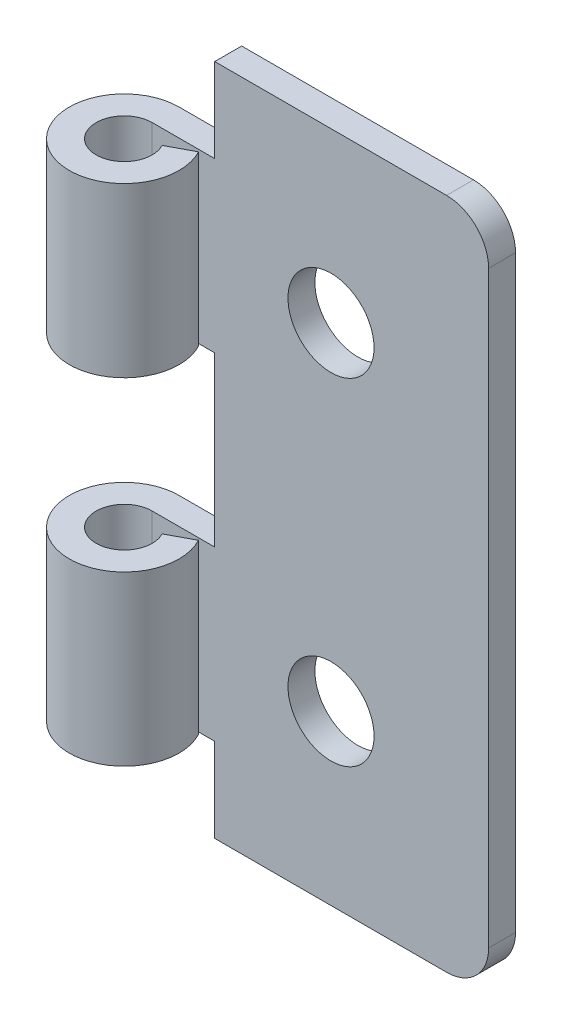
ISO-10303-21;
HEADER;
FILE_DESCRIPTION(('STEP AP214'),'2;1');
FILE_NAME('part.step','',(''),(''),'','','');
FILE_SCHEMA(('AUTOMOTIVE_DESIGN { 1 0 10303 214 1 1 1 1 }'));
ENDSEC;
DATA;
#1=APPLICATION_CONTEXT('core data for automotive mechanical design processes');
#2=APPLICATION_PROTOCOL_DEFINITION('international standard','automotive_design',2000,#1);
#3=PRODUCT_CONTEXT('',#1,'mechanical');
#4=PRODUCT('Part','Part','',(#3));
#5=PRODUCT_RELATED_PRODUCT_CATEGORY('part','',(#4));
#6=PRODUCT_DEFINITION_FORMATION('','',#4);
#7=PRODUCT_DEFINITION_CONTEXT('part definition',#1,'design');
#8=PRODUCT_DEFINITION('design','',#6,#7);
#9=PRODUCT_DEFINITION_SHAPE('','',#8);
#10=(LENGTH_UNIT() NAMED_UNIT(*) SI_UNIT(.MILLI.,.METRE.));
#11=(NAMED_UNIT(*) PLANE_ANGLE_UNIT() SI_UNIT($,.RADIAN.));
#12=(NAMED_UNIT(*) SI_UNIT($,.STERADIAN.) SOLID_ANGLE_UNIT());
#13=UNCERTAINTY_MEASURE_WITH_UNIT(LENGTH_MEASURE(1.E-05),#10,'distance_accuracy_value','');
#14=(GEOMETRIC_REPRESENTATION_CONTEXT(3) GLOBAL_UNCERTAINTY_ASSIGNED_CONTEXT((#13)) GLOBAL_UNIT_ASSIGNED_CONTEXT((#10,
#11,#12)) REPRESENTATION_CONTEXT('',''));
#15=CARTESIAN_POINT('',(0.,0.,0.));
#16=DIRECTION('',(0.,0.,1.));
#17=DIRECTION('',(1.,0.,0.));
#18=AXIS2_PLACEMENT_3D('',#15,#16,#17);
#19=CARTESIAN_POINT('',(2.70058281293117E-10,-19.0500000015001,4.1486666669938));
#20=DIRECTION('',(0.,1.,0.));
#21=DIRECTION('',(-0.990472978806965,0.,0.137707219321494));
#22=AXIS2_PLACEMENT_3D('',#19,#20,#21);
#23=CYLINDRICAL_SURFACE('',#22,2.11666666763317);
#24=CARTESIAN_POINT('',(2.70058281293117E-10,-19.0500000015001,4.1486666669938));
#25=DIRECTION('',(0.,1.,0.));
#26=DIRECTION('',(-0.990472978806965,0.,0.137707219321494));
#27=AXIS2_PLACEMENT_3D('',#24,#25,#26);
#28=CIRCLE('',#27,2.11666666763317);
#29=CARTESIAN_POINT('',(1.86869045346746,-19.0500000015001,3.15454707056779));
#30=VERTEX_POINT('',#29);
#31=CARTESIAN_POINT('',(1.96545904551648E-09,-19.0500000015001,2.03199999936063));
#32=VERTEX_POINT('',#31);
#33=EDGE_CURVE('E200',#30,#32,#28,.F.);
#34=ORIENTED_EDGE('',*,*,#33,.T.);
#35=DIRECTION('',(0.,-1.,0.));
#36=VECTOR('',#35,1.);
#37=CARTESIAN_POINT('',(3.66086154446332E-09,-19.0500000015001,2.03199999936063));
#38=LINE('',#37,#36);
#39=CARTESIAN_POINT('',(1.31762586952355E-08,-6.35000000037509,2.03199999955212));
#40=VERTEX_POINT('',#39);
#41=EDGE_CURVE('E262',#40,#32,#38,.T.);
#42=ORIENTED_EDGE('',*,*,#41,.F.);
#43=CARTESIAN_POINT('',(2.70058281293117E-10,-6.35000000037509,4.1486666669938));
#44=DIRECTION('',(0.,1.,0.));
#45=DIRECTION('',(-0.990472978806965,0.,0.137707219321494));
#46=AXIS2_PLACEMENT_3D('',#43,#44,#45);
#47=CIRCLE('',#46,2.11666666763317);
#48=CARTESIAN_POINT('',(1.86869045346746,-6.35000000037509,3.15454707056779));
#49=VERTEX_POINT('',#48);
#50=EDGE_CURVE('E183',#49,#40,#47,.F.);
#51=ORIENTED_EDGE('',*,*,#50,.F.);
#52=DIRECTION('',(0.,-1.,0.));
#53=VECTOR('',#52,1.);
#54=CARTESIAN_POINT('',(1.86869045346746,-19.0500000015001,3.15454707056779));
#55=LINE('',#54,#53);
#56=EDGE_CURVE('E164',#30,#49,#55,.F.);
#57=ORIENTED_EDGE('',*,*,#56,.F.);
#58=EDGE_LOOP('',(#34,#42,#51,#57));
#59=FACE_BOUND('',#58,.T.);
#60=ADVANCED_FACE('F17',(#59),#23,.F.);
#61=CARTESIAN_POINT('',(3.66263328715336,-19.0500000015001,2.20019225873489));
#62=DIRECTION('',(-0.469662801246651,0.,-0.882845882997225));
#63=DIRECTION('',(0.882845882997225,0.,-0.469662801246651));
#64=AXIS2_PLACEMENT_3D('',#61,#62,#63);
#65=PLANE('',#64);
#66=DIRECTION('',(-0.882845882997224,0.,0.469662801246651));
#67=VECTOR('',#66,1.);
#68=CARTESIAN_POINT('',(3.66263328715336,-19.0500000015001,2.20019225873488));
#69=LINE('',#68,#67);
#70=CARTESIAN_POINT('',(3.66263328715336,-19.0500000015001,2.20019225873488));
#71=VERTEX_POINT('',#70);
#72=EDGE_CURVE('E203',#71,#30,#69,.T.);
#73=ORIENTED_EDGE('',*,*,#72,.T.);
#74=ORIENTED_EDGE('',*,*,#56,.T.);
#75=DIRECTION('',(-0.882845882997224,0.,0.469662801246651));
#76=VECTOR('',#75,1.);
#77=CARTESIAN_POINT('',(3.66263328715336,-6.35000000037509,2.20019225873488));
#78=LINE('',#77,#76);
#79=CARTESIAN_POINT('',(3.66263328715336,-6.35000000037509,2.20019225873488));
#80=VERTEX_POINT('',#79);
#81=EDGE_CURVE('E146',#80,#49,#78,.T.);
#82=ORIENTED_EDGE('',*,*,#81,.F.);
#83=DIRECTION('',(0.,-1.,0.));
#84=VECTOR('',#83,1.);
#85=CARTESIAN_POINT('',(3.66263328715336,-19.0500000015001,2.20019225873489));
#86=LINE('',#85,#84);
#87=EDGE_CURVE('E157',#80,#71,#86,.T.);
#88=ORIENTED_EDGE('',*,*,#87,.T.);
#89=EDGE_LOOP('',(#73,#74,#82,#88));
#90=FACE_BOUND('',#89,.T.);
#91=ADVANCED_FACE('F167',(#90),#65,.T.);
#92=CARTESIAN_POINT('',(1.86869045251002,19.0500000004999,3.15454707011616));
#93=DIRECTION('',(0.469662801482301,0.,0.882845882871862));
#94=DIRECTION('',(-0.882845882871862,0.,0.469662801482301));
#95=AXIS2_PLACEMENT_3D('',#92,#93,#94);
#96=PLANE('',#95);
#97=DIRECTION('',(0.,-1.,0.));
#98=VECTOR('',#97,1.);
#99=CARTESIAN_POINT('',(1.86869045251002,19.0500000004999,3.15454707011616));
#100=LINE('',#99,#98);
#101=CARTESIAN_POINT('',(1.86869045251002,19.0500000004999,3.15454707011616));
#102=VERTEX_POINT('',#101);
#103=CARTESIAN_POINT('',(1.86869045251002,6.3500000004999,3.15454707011616));
#104=VERTEX_POINT('',#103);
#105=EDGE_CURVE('E263',#102,#104,#100,.T.);
#106=ORIENTED_EDGE('',*,*,#105,.F.);
#107=DIRECTION('',(-0.882845882871862,0.,0.469662801482301));
#108=VECTOR('',#107,1.);
#109=CARTESIAN_POINT('',(3.66263328650564,19.0500000004999,2.20019225750412));
#110=LINE('',#109,#108);
#111=CARTESIAN_POINT('',(3.66263328650564,19.0500000004999,2.20019225750412));
#112=VERTEX_POINT('',#111);
#113=EDGE_CURVE('E314',#112,#102,#110,.T.);
#114=ORIENTED_EDGE('',*,*,#113,.F.);
#115=DIRECTION('',(0.,-1.,0.));
#116=VECTOR('',#115,1.);
#117=CARTESIAN_POINT('',(3.66263328650564,19.0500000004999,2.20019225750412));
#118=LINE('',#117,#116);
#119=CARTESIAN_POINT('',(3.66263328650564,6.3500000004999,2.20019225750412));
#120=VERTEX_POINT('',#119);
#121=EDGE_CURVE('E264',#120,#112,#118,.F.);
#122=ORIENTED_EDGE('',*,*,#121,.F.);
#123=DIRECTION('',(-0.882845882871862,0.,0.469662801482301));
#124=VECTOR('',#123,1.);
#125=CARTESIAN_POINT('',(3.66263328650564,6.35000000049991,2.20019225750412));
#126=LINE('',#125,#124);
#127=EDGE_CURVE('E274',#120,#104,#126,.T.);
#128=ORIENTED_EDGE('',*,*,#127,.T.);
#129=EDGE_LOOP('',(#106,#114,#122,#128));
#130=FACE_BOUND('',#129,.T.);
#131=ADVANCED_FACE('F507',(#130),#96,.F.);
#132=CARTESIAN_POINT('',(1.36959887875321E-10,19.0500000004999,4.14866666674361));
#133=DIRECTION('',(0.,-1.,0.));
#134=DIRECTION('',(0.990472978806965,0.,-0.137707219321494));
#135=AXIS2_PLACEMENT_3D('',#132,#133,#134);
#136=CYLINDRICAL_SURFACE('',#135,2.11666666700002);
#137=CARTESIAN_POINT('',(1.36959887875321E-10,19.0500000004999,4.14866666674361));
#138=DIRECTION('',(0.,-1.,0.));
#139=DIRECTION('',(0.990472978806965,0.,-0.137707219321494));
#140=AXIS2_PLACEMENT_3D('',#137,#138,#139);
#141=CIRCLE('',#140,2.11666666700002);
#142=CARTESIAN_POINT('',(1.36963357322273E-10,19.0500000004999,2.0319999995521));
#143=VERTEX_POINT('',#142);
#144=EDGE_CURVE('E310',#102,#143,#141,.T.);
#145=ORIENTED_EDGE('',*,*,#144,.F.);
#146=ORIENTED_EDGE('',*,*,#105,.T.);
#147=CARTESIAN_POINT('',(1.36959887875321E-10,6.35000000049991,4.14866666674361));
#148=DIRECTION('',(0.,-1.,0.));
#149=DIRECTION('',(0.990472978806965,0.,-0.137707219321494));
#150=AXIS2_PLACEMENT_3D('',#147,#148,#149);
#151=CIRCLE('',#150,2.11666666700002);
#152=CARTESIAN_POINT('',(1.36959887875321E-10,6.35000000049991,2.03199999955211));
#153=VERTEX_POINT('',#152);
#154=EDGE_CURVE('E322',#104,#153,#151,.T.);
#155=ORIENTED_EDGE('',*,*,#154,.T.);
#156=DIRECTION('',(0.,-1.,0.));
#157=VECTOR('',#156,1.);
#158=CARTESIAN_POINT('',(1.36961622598797E-10,-19.0500000015001,2.03199999936063));
#159=LINE('',#158,#157);
#160=EDGE_CURVE('E258',#143,#153,#159,.T.);
#161=ORIENTED_EDGE('',*,*,#160,.F.);
#162=EDGE_LOOP('',(#145,#146,#155,#161));
#163=FACE_BOUND('',#162,.T.);
#164=ADVANCED_FACE('F361',(#163),#136,.F.);
#165=CARTESIAN_POINT('',(2.70058281293117E-10,-19.0500000015001,2.03199999936063));
#166=DIRECTION('',(0.,0.,1.));
#167=DIRECTION('',(-1.,0.,0.));
#168=AXIS2_PLACEMENT_3D('',#165,#166,#167);
#169=PLANE('',#168);
#170=DIRECTION('',(1.,0.,0.));
#171=VECTOR('',#170,1.);
#172=CARTESIAN_POINT('',(4.72096662113696,-25.4000000015001,2.03199999974361));
#173=LINE('',#172,#171);
#174=CARTESIAN_POINT('',(4.72096662113696,-25.4000000015001,2.03199999948829));
#175=VERTEX_POINT('',#174);
#176=CARTESIAN_POINT('',(22.2250000022701,-25.4000000015001,2.03199999974364));
#177=VERTEX_POINT('',#176);
#178=EDGE_CURVE('E225',#175,#177,#173,.T.);
#179=ORIENTED_EDGE('',*,*,#178,.T.);
#180=CARTESIAN_POINT('',(22.2250000022701,-22.2250000015001,2.03199999974368));
#181=DIRECTION('',(0.,0.,1.));
#182=DIRECTION('',(-1.,0.,0.));
#183=AXIS2_PLACEMENT_3D('',#180,#181,#182);
#184=CIRCLE('',#183,3.175);
#185=CARTESIAN_POINT('',(25.4000000022701,-22.2250000015001,2.03199999974368));
#186=VERTEX_POINT('',#185);
#187=EDGE_CURVE('E230',#186,#177,#184,.F.);
#188=ORIENTED_EDGE('',*,*,#187,.F.);
#189=DIRECTION('',(0.,-1.,0.));
#190=VECTOR('',#189,1.);
#191=CARTESIAN_POINT('',(25.4000000022701,-2.42604837035899,2.03199999974367));
#192=LINE('',#191,#190);
#193=CARTESIAN_POINT('',(25.4000000022701,22.2250000014999,2.03199999974362));
#194=VERTEX_POINT('',#193);
#195=EDGE_CURVE('E234',#186,#194,#192,.F.);
#196=ORIENTED_EDGE('',*,*,#195,.T.);
#197=CARTESIAN_POINT('',(22.2250000022701,22.2250000014999,2.03199999974358));
#198=DIRECTION('',(0.,0.,-1.));
#199=DIRECTION('',(1.,0.,0.));
#200=AXIS2_PLACEMENT_3D('',#197,#198,#199);
#201=CIRCLE('',#200,3.175);
#202=CARTESIAN_POINT('',(22.2250000022701,25.4000000014999,2.03199999974358));
#203=VERTEX_POINT('',#202);
#204=EDGE_CURVE('E239',#203,#194,#201,.T.);
#205=ORIENTED_EDGE('',*,*,#204,.F.);
#206=DIRECTION('',(-1.,0.,0.));
#207=VECTOR('',#206,1.);
#208=CARTESIAN_POINT('',(22.2250000022701,25.4000000014999,2.03199999974358));
#209=LINE('',#208,#207);
#210=CARTESIAN_POINT('',(4.72096662113696,25.4000000014999,2.03199999974359));
#211=VERTEX_POINT('',#210);
#212=EDGE_CURVE('E252',#203,#211,#209,.T.);
#213=ORIENTED_EDGE('',*,*,#212,.T.);
#214=DIRECTION('',(0.,-1.,0.));
#215=VECTOR('',#214,1.);
#216=CARTESIAN_POINT('',(4.72096662113696,25.4000000014999,2.03199999974359));
#217=LINE('',#216,#215);
#218=CARTESIAN_POINT('',(4.72096662113696,19.0500000004999,2.03199999974359));
#219=VERTEX_POINT('',#218);
#220=EDGE_CURVE('E244',#211,#219,#217,.T.);
#221=ORIENTED_EDGE('',*,*,#220,.T.);
#222=DIRECTION('',(1.,0.,0.));
#223=VECTOR('',#222,1.);
#224=CARTESIAN_POINT('',(1.36959887875321E-10,19.0500000004999,2.03199999974358));
#225=LINE('',#224,#223);
#226=EDGE_CURVE('E245',#143,#219,#225,.T.);
#227=ORIENTED_EDGE('',*,*,#226,.F.);
#228=ORIENTED_EDGE('',*,*,#160,.T.);
#229=DIRECTION('',(1.,0.,0.));
#230=VECTOR('',#229,1.);
#231=CARTESIAN_POINT('',(1.36959887875321E-10,6.35000000049991,2.03199999974358));
#232=LINE('',#231,#230);
#233=CARTESIAN_POINT('',(4.72096662466088,6.35000000049991,2.03200001641314));
#234=VERTEX_POINT('',#233);
#235=EDGE_CURVE('E324',#153,#234,#232,.T.);
#236=ORIENTED_EDGE('',*,*,#235,.T.);
#237=DIRECTION('',(0.,-1.,0.));
#238=VECTOR('',#237,1.);
#239=CARTESIAN_POINT('',(4.72096662466088,-2.42604837035896,2.03200004975225));
#240=LINE('',#239,#238);
#241=CARTESIAN_POINT('',(4.72096662466088,-6.350000005626,2.03200004975225));
#242=VERTEX_POINT('',#241);
#243=EDGE_CURVE('E175',#242,#234,#240,.F.);
#244=ORIENTED_EDGE('',*,*,#243,.F.);
#245=DIRECTION('',(1.,0.,1.05928802118793E-08));
#246=VECTOR('',#245,1.);
#247=CARTESIAN_POINT('',(3.6608632791868E-09,-6.35000000037509,2.03199999974361));
#248=LINE('',#247,#246);
#249=EDGE_CURVE('E153',#40,#242,#248,.T.);
#250=ORIENTED_EDGE('',*,*,#249,.F.);
#251=ORIENTED_EDGE('',*,*,#41,.T.);
#252=DIRECTION('',(1.,0.,0.));
#253=VECTOR('',#252,1.);
#254=CARTESIAN_POINT('',(2.70056546569641E-10,-19.0500000015001,2.03199999936063));
#255=LINE('',#254,#253);
#256=CARTESIAN_POINT('',(4.72096662113696,-19.0500000015001,2.03199999936063));
#257=VERTEX_POINT('',#256);
#258=EDGE_CURVE('E196',#32,#257,#255,.T.);
#259=ORIENTED_EDGE('',*,*,#258,.T.);
#260=DIRECTION('',(0.,-1.,0.));
#261=VECTOR('',#260,1.);
#262=CARTESIAN_POINT('',(4.72096662113697,-25.4000000015001,2.03199999936063));
#263=LINE('',#262,#261);
#264=EDGE_CURVE('E219',#257,#175,#263,.T.);
#265=ORIENTED_EDGE('',*,*,#264,.T.);
#266=EDGE_LOOP('',(#179,#188,#196,#205,#213,#221,#227,#228,#236,#244,#250,#251,#259,#265));
#267=FACE_BOUND('',#266,.T.);
#268=CARTESIAN_POINT('',(13.499676668137,12.7000000006249,2.03199999936062));
#269=DIRECTION('',(0.,0.,-1.));
#270=DIRECTION('',(1.,0.,0.));
#271=AXIS2_PLACEMENT_3D('',#268,#269,#270);
#272=CIRCLE('',#271,3.24999999999999);
#273=CARTESIAN_POINT('',(16.7496766681369,12.7000000006249,2.03199999936062));
#274=VERTEX_POINT('',#273);
#275=EDGE_CURVE('E255',#274,#274,#272,.T.);
#276=ORIENTED_EDGE('',*,*,#275,.T.);
#277=EDGE_LOOP('',(#276));
#278=FACE_BOUND('',#277,.T.);
#279=CARTESIAN_POINT('',(13.499676668137,-12.7000000003751,2.03199999936063));
#280=DIRECTION('',(0.,0.,-1.));
#281=DIRECTION('',(1.,0.,0.));
#282=AXIS2_PLACEMENT_3D('',#279,#280,#281);
#283=CIRCLE('',#282,3.24999999999999);
#284=CARTESIAN_POINT('',(16.7496766681369,-12.7000000003751,2.03199999936062));
#285=VERTEX_POINT('',#284);
#286=EDGE_CURVE('E20',#285,#285,#283,.T.);
#287=ORIENTED_EDGE('',*,*,#286,.T.);
#288=EDGE_LOOP('',(#287));
#289=FACE_BOUND('',#288,.T.);
#290=ADVANCED_FACE('F345',(#267,#278,#289),#169,.T.);
#291=CARTESIAN_POINT('',(13.499676668137,-12.7000000003751,0.));
#292=DIRECTION('',(0.,0.,-1.));
#293=DIRECTION('',(1.,0.,0.));
#294=AXIS2_PLACEMENT_3D('',#291,#292,#293);
#295=CYLINDRICAL_SURFACE('',#294,3.24999999999999);
#296=CARTESIAN_POINT('',(13.499676668137,-12.7000000003751,0.));
#297=DIRECTION('',(0.,0.,-1.));
#298=DIRECTION('',(1.,0.,0.));
#299=AXIS2_PLACEMENT_3D('',#296,#297,#298);
#300=CIRCLE('',#299,3.24999999999999);
#301=CARTESIAN_POINT('',(16.7496766681369,-12.7000000003751,0.));
#302=VERTEX_POINT('',#301);
#303=EDGE_CURVE('E306',#302,#302,#300,.F.);
#304=ORIENTED_EDGE('',*,*,#303,.F.);
#305=EDGE_LOOP('',(#304));
#306=FACE_BOUND('',#305,.T.);
#307=ORIENTED_EDGE('',*,*,#286,.F.);
#308=EDGE_LOOP('',(#307));
#309=FACE_BOUND('',#308,.T.);
#310=ADVANCED_FACE('F347',(#306,#309),#295,.F.);
#311=CARTESIAN_POINT('',(13.499676668137,12.7000000006249,0.));
#312=DIRECTION('',(0.,0.,-1.));
#313=DIRECTION('',(1.,0.,0.));
#314=AXIS2_PLACEMENT_3D('',#311,#312,#313);
#315=CYLINDRICAL_SURFACE('',#314,3.24999999999999);
#316=CARTESIAN_POINT('',(13.499676668137,12.7000000006249,0.));
#317=DIRECTION('',(0.,0.,-1.));
#318=DIRECTION('',(1.,0.,0.));
#319=AXIS2_PLACEMENT_3D('',#316,#317,#318);
#320=CIRCLE('',#319,3.24999999999999);
#321=CARTESIAN_POINT('',(16.7496766681369,12.7000000006249,0.));
#322=VERTEX_POINT('',#321);
#323=EDGE_CURVE('E302',#322,#322,#320,.F.);
#324=ORIENTED_EDGE('',*,*,#323,.F.);
#325=EDGE_LOOP('',(#324));
#326=FACE_BOUND('',#325,.T.);
#327=ORIENTED_EDGE('',*,*,#275,.F.);
#328=EDGE_LOOP('',(#327));
#329=FACE_BOUND('',#328,.T.);
#330=ADVANCED_FACE('F349',(#326,#329),#315,.F.);
#331=CARTESIAN_POINT('',(-15.0777173125147,25.4000000014999,2.76877995558586));
#332=DIRECTION('',(0.,-1.,0.));
#333=DIRECTION('',(0.990472978806965,0.,-0.137707219321494));
#334=AXIS2_PLACEMENT_3D('',#331,#332,#333);
#335=PLANE('',#334);
#336=DIRECTION('',(0.,0.,-1.));
#337=VECTOR('',#336,1.);
#338=CARTESIAN_POINT('',(22.2250000022701,25.4000000014999,2.7687799555858));
#339=LINE('',#338,#337);
#340=CARTESIAN_POINT('',(22.2250000022701,25.4000000014999,-1.28167008256463E-10));
#341=VERTEX_POINT('',#340);
#342=EDGE_CURVE('E235',#341,#203,#339,.F.);
#343=ORIENTED_EDGE('',*,*,#342,.F.);
#344=DIRECTION('',(1.,0.,0.));
#345=VECTOR('',#344,1.);
#346=CARTESIAN_POINT('',(2.11563514084296,25.4000000014999,0.));
#347=LINE('',#346,#345);
#348=CARTESIAN_POINT('',(4.72096662113696,25.4000000014999,0.));
#349=VERTEX_POINT('',#348);
#350=EDGE_CURVE('E301',#349,#341,#347,.T.);
#351=ORIENTED_EDGE('',*,*,#350,.F.);
#352=DIRECTION('',(0.,0.,1.));
#353=VECTOR('',#352,1.);
#354=CARTESIAN_POINT('',(4.72096662113696,25.4000000014999,2.03199999974359));
#355=LINE('',#354,#353);
#356=EDGE_CURVE('E240',#349,#211,#355,.T.);
#357=ORIENTED_EDGE('',*,*,#356,.T.);
#358=ORIENTED_EDGE('',*,*,#212,.F.);
#359=EDGE_LOOP('',(#343,#351,#357,#358));
#360=FACE_BOUND('',#359,.T.);
#361=ADVANCED_FACE('F358',(#360),#335,.F.);
#362=CARTESIAN_POINT('',(22.2250000022701,22.2250000014999,2.7687799555858));
#363=DIRECTION('',(0.,0.,-1.));
#364=DIRECTION('',(1.,0.,0.));
#365=AXIS2_PLACEMENT_3D('',#362,#363,#364);
#366=CYLINDRICAL_SURFACE('',#365,3.175);
#367=CARTESIAN_POINT('',(22.2250000022701,22.2250000014999,-2.56323608172071E-10));
#368=DIRECTION('',(0.,0.,-1.));
#369=DIRECTION('',(1.,0.,0.));
#370=AXIS2_PLACEMENT_3D('',#367,#368,#369);
#371=CIRCLE('',#370,3.175);
#372=CARTESIAN_POINT('',(25.4000000022701,22.2250000014999,-1.28168742979939E-10));
#373=VERTEX_POINT('',#372);
#374=EDGE_CURVE('E297',#341,#373,#371,.T.);
#375=ORIENTED_EDGE('',*,*,#374,.F.);
#376=ORIENTED_EDGE('',*,*,#342,.T.);
#377=ORIENTED_EDGE('',*,*,#204,.T.);
#378=DIRECTION('',(0.,0.,-1.));
#379=VECTOR('',#378,1.);
#380=CARTESIAN_POINT('',(25.4000000022701,22.2250000014999,2.76877995558579));
#381=LINE('',#380,#379);
#382=EDGE_CURVE('E231',#194,#373,#381,.T.);
#383=ORIENTED_EDGE('',*,*,#382,.T.);
#384=EDGE_LOOP('',(#375,#376,#377,#383));
#385=FACE_BOUND('',#384,.T.);
#386=ADVANCED_FACE('F417',(#385),#366,.T.);
#387=CARTESIAN_POINT('',(25.4000000022701,-2.42604837035899,2.76877995558579));
#388=DIRECTION('',(-1.,0.,0.));
#389=DIRECTION('',(0.,0.,-1.));
#390=AXIS2_PLACEMENT_3D('',#387,#388,#389);
#391=PLANE('',#390);
#392=ORIENTED_EDGE('',*,*,#382,.F.);
#393=ORIENTED_EDGE('',*,*,#195,.F.);
#394=DIRECTION('',(0.,0.,1.));
#395=VECTOR('',#394,1.);
#396=CARTESIAN_POINT('',(25.4000000022701,-22.2250000015001,2.7687799555858));
#397=LINE('',#396,#395);
#398=CARTESIAN_POINT('',(25.4000000022701,-22.2250000015001,-1.28209942662494E-10));
#399=VERTEX_POINT('',#398);
#400=EDGE_CURVE('E226',#399,#186,#397,.T.);
#401=ORIENTED_EDGE('',*,*,#400,.F.);
#402=DIRECTION('',(0.,-1.,0.));
#403=VECTOR('',#402,1.);
#404=CARTESIAN_POINT('',(25.4000000022701,-19.0500000015001,0.));
#405=LINE('',#404,#403);
#406=EDGE_CURVE('E296',#373,#399,#405,.T.);
#407=ORIENTED_EDGE('',*,*,#406,.F.);
#408=EDGE_LOOP('',(#392,#393,#401,#407));
#409=FACE_BOUND('',#408,.T.);
#410=ADVANCED_FACE('F413',(#409),#391,.F.);
#411=CARTESIAN_POINT('',(22.2250000022701,-22.2250000015001,2.7687799555858));
#412=DIRECTION('',(0.,0.,1.));
#413=DIRECTION('',(-1.,0.,0.));
#414=AXIS2_PLACEMENT_3D('',#411,#412,#413);
#415=CYLINDRICAL_SURFACE('',#414,3.175);
#416=ORIENTED_EDGE('',*,*,#187,.T.);
#417=DIRECTION('',(0.,0.,-1.));
#418=VECTOR('',#417,1.);
#419=CARTESIAN_POINT('',(22.2250000022701,-25.4000000015001,2.03199999974359));
#420=LINE('',#419,#418);
#421=CARTESIAN_POINT('',(22.2250000022701,-25.4000000015001,-1.28206906896411E-10));
#422=VERTEX_POINT('',#421);
#423=EDGE_CURVE('E222',#177,#422,#420,.T.);
#424=ORIENTED_EDGE('',*,*,#423,.T.);
#425=CARTESIAN_POINT('',(22.2250000022701,-22.2250000015001,-2.56410778026739E-10));
#426=DIRECTION('',(0.,0.,1.));
#427=DIRECTION('',(-1.,0.,0.));
#428=AXIS2_PLACEMENT_3D('',#425,#426,#427);
#429=CIRCLE('',#428,3.175);
#430=EDGE_CURVE('E292',#399,#422,#429,.F.);
#431=ORIENTED_EDGE('',*,*,#430,.F.);
#432=ORIENTED_EDGE('',*,*,#400,.T.);
#433=EDGE_LOOP('',(#416,#424,#431,#432));
#434=FACE_BOUND('',#433,.T.);
#435=ADVANCED_FACE('F409',(#434),#415,.T.);
#436=CARTESIAN_POINT('',(-15.0777173125147,-25.4000000015001,2.76877995558587));
#437=DIRECTION('',(0.,1.,0.));
#438=DIRECTION('',(-0.990472978806965,0.,0.137707219321494));
#439=AXIS2_PLACEMENT_3D('',#436,#437,#438);
#440=PLANE('',#439);
#441=ORIENTED_EDGE('',*,*,#423,.F.);
#442=ORIENTED_EDGE('',*,*,#178,.F.);
#443=DIRECTION('',(0.,0.,1.));
#444=VECTOR('',#443,1.);
#445=CARTESIAN_POINT('',(4.72096662113696,-25.4000000015001,-2.56389093983289E-10));
#446=LINE('',#445,#444);
#447=CARTESIAN_POINT('',(4.72096662113696,-25.4000000015001,0.));
#448=VERTEX_POINT('',#447);
#449=EDGE_CURVE('E206',#175,#448,#446,.F.);
#450=ORIENTED_EDGE('',*,*,#449,.T.);
#451=DIRECTION('',(1.,0.,0.));
#452=VECTOR('',#451,1.);
#453=CARTESIAN_POINT('',(2.11563514084296,-25.4000000015001,0.));
#454=LINE('',#453,#452);
#455=EDGE_CURVE('E214',#422,#448,#454,.F.);
#456=ORIENTED_EDGE('',*,*,#455,.F.);
#457=EDGE_LOOP('',(#441,#442,#450,#456));
#458=FACE_BOUND('',#457,.T.);
#459=ADVANCED_FACE('F405',(#458),#440,.F.);
#460=CARTESIAN_POINT('',(4.72096662113696,-25.4000000015001,-2.56389093983289E-10));
#461=DIRECTION('',(1.,0.,0.));
#462=DIRECTION('',(0.,0.,1.));
#463=AXIS2_PLACEMENT_3D('',#460,#461,#462);
#464=PLANE('',#463);
#465=DIRECTION('',(0.,-1.,0.));
#466=VECTOR('',#465,1.);
#467=CARTESIAN_POINT('',(4.72096662113696,-19.0500000015001,0.));
#468=LINE('',#467,#466);
#469=CARTESIAN_POINT('',(4.72096662113696,-19.0500000015001,0.));
#470=VERTEX_POINT('',#469);
#471=EDGE_CURVE('E193',#448,#470,#468,.F.);
#472=ORIENTED_EDGE('',*,*,#471,.F.);
#473=ORIENTED_EDGE('',*,*,#449,.F.);
#474=ORIENTED_EDGE('',*,*,#264,.F.);
#475=DIRECTION('',(0.,0.,-1.));
#476=VECTOR('',#475,1.);
#477=CARTESIAN_POINT('',(4.72096662113696,-19.0500000015001,2.03199999936063));
#478=LINE('',#477,#476);
#479=EDGE_CURVE('E199',#257,#470,#478,.T.);
#480=ORIENTED_EDGE('',*,*,#479,.T.);
#481=EDGE_LOOP('',(#472,#473,#474,#480));
#482=FACE_BOUND('',#481,.T.);
#483=ADVANCED_FACE('F401',(#482),#464,.F.);
#484=CARTESIAN_POINT('',(2.70058281293117E-10,-19.0500000015001,4.1486666669938));
#485=DIRECTION('',(0.,1.,0.));
#486=DIRECTION('',(-0.990472978806965,0.,0.137707219321494));
#487=AXIS2_PLACEMENT_3D('',#484,#485,#486);
#488=PLANE('',#487);
#489=ORIENTED_EDGE('',*,*,#258,.F.);
#490=ORIENTED_EDGE('',*,*,#33,.F.);
#491=ORIENTED_EDGE('',*,*,#72,.F.);
#492=CARTESIAN_POINT('',(2.70058281293117E-10,-19.0500000015001,4.1486666669938));
#493=DIRECTION('',(0.,1.,0.));
#494=DIRECTION('',(-0.990472978806965,0.,0.137707219321494));
#495=AXIS2_PLACEMENT_3D('',#492,#493,#494);
#496=CIRCLE('',#495,4.14866666699381);
#497=CARTESIAN_POINT('',(2.70054811846165E-10,-19.0500000015001,0.));
#498=VERTEX_POINT('',#497);
#499=EDGE_CURVE('E159',#498,#71,#496,.T.);
#500=ORIENTED_EDGE('',*,*,#499,.F.);
#501=DIRECTION('',(1.,0.,0.));
#502=VECTOR('',#501,1.);
#503=CARTESIAN_POINT('',(2.11563514084296,-19.0500000015001,0.));
#504=LINE('',#503,#502);
#505=EDGE_CURVE('E189',#470,#498,#504,.F.);
#506=ORIENTED_EDGE('',*,*,#505,.F.);
#507=ORIENTED_EDGE('',*,*,#479,.F.);
#508=EDGE_LOOP('',(#489,#490,#491,#500,#506,#507));
#509=FACE_BOUND('',#508,.T.);
#510=ADVANCED_FACE('F398',(#509),#488,.F.);
#511=CARTESIAN_POINT('',(2.70058281293117E-10,-19.0500000015001,4.1486666669938));
#512=DIRECTION('',(0.,1.,0.));
#513=DIRECTION('',(-0.990472978806965,0.,0.137707219321494));
#514=AXIS2_PLACEMENT_3D('',#511,#512,#513);
#515=CYLINDRICAL_SURFACE('',#514,4.14866666699381);
#516=CARTESIAN_POINT('',(2.70058281293117E-10,-6.35000000037509,4.1486666669938));
#517=DIRECTION('',(0.,1.,0.));
#518=DIRECTION('',(-0.990472978806965,0.,0.137707219321494));
#519=AXIS2_PLACEMENT_3D('',#516,#517,#518);
#520=CIRCLE('',#519,4.14866666699381);
#521=CARTESIAN_POINT('',(2.70054811846165E-10,-6.35000000031259,0.));
#522=VERTEX_POINT('',#521);
#523=EDGE_CURVE('E141',#522,#80,#520,.T.);
#524=ORIENTED_EDGE('',*,*,#523,.F.);
#525=DIRECTION('',(0.,-1.,0.));
#526=VECTOR('',#525,1.);
#527=CARTESIAN_POINT('',(2.70054811846165E-10,-19.0500000015001,0.));
#528=LINE('',#527,#526);
#529=EDGE_CURVE('E186',#498,#522,#528,.F.);
#530=ORIENTED_EDGE('',*,*,#529,.F.);
#531=ORIENTED_EDGE('',*,*,#499,.T.);
#532=ORIENTED_EDGE('',*,*,#87,.F.);
#533=EDGE_LOOP('',(#524,#530,#531,#532));
#534=FACE_BOUND('',#533,.T.);
#535=ADVANCED_FACE('F158',(#534),#515,.T.);
#536=CARTESIAN_POINT('',(2.70058281293117E-10,-6.35000000037509,4.1486666669938));
#537=DIRECTION('',(0.,1.,0.));
#538=DIRECTION('',(-0.990472978806965,0.,0.137707219321494));
#539=AXIS2_PLACEMENT_3D('',#536,#537,#538);
#540=PLANE('',#539);
#541=ORIENTED_EDGE('',*,*,#523,.T.);
#542=ORIENTED_EDGE('',*,*,#81,.T.);
#543=ORIENTED_EDGE('',*,*,#50,.T.);
#544=ORIENTED_EDGE('',*,*,#249,.T.);
#545=DIRECTION('',(0.,0.,-1.));
#546=VECTOR('',#545,1.);
#547=CARTESIAN_POINT('',(4.72096662466088,-6.35000000825145,2.7687799555859));
#548=LINE('',#547,#546);
#549=CARTESIAN_POINT('',(4.72096662466089,-6.35000000291721,0.));
#550=VERTEX_POINT('',#549);
#551=EDGE_CURVE('E170',#550,#242,#548,.F.);
#552=ORIENTED_EDGE('',*,*,#551,.F.);
#553=DIRECTION('',(1.,0.,0.));
#554=VECTOR('',#553,1.);
#555=CARTESIAN_POINT('',(2.11563514084296,-6.35000000025009,0.));
#556=LINE('',#555,#554);
#557=EDGE_CURVE('E148',#522,#550,#556,.T.);
#558=ORIENTED_EDGE('',*,*,#557,.F.);
#559=EDGE_LOOP('',(#541,#542,#543,#544,#552,#558));
#560=FACE_BOUND('',#559,.T.);
#561=ADVANCED_FACE('F143',(#560),#540,.T.);
#562=CARTESIAN_POINT('',(4.72096662466088,-2.42604837035896,2.7687799555859));
#563=DIRECTION('',(-1.,0.,0.));
#564=DIRECTION('',(0.,0.,-1.));
#565=AXIS2_PLACEMENT_3D('',#562,#563,#564);
#566=PLANE('',#565);
#567=DIRECTION('',(0.,0.,-1.));
#568=VECTOR('',#567,1.);
#569=CARTESIAN_POINT('',(4.72096662466087,6.35000000049991,2.03199999974358));
#570=LINE('',#569,#568);
#571=CARTESIAN_POINT('',(4.72096662466089,6.349999995249,0.));
#572=VERTEX_POINT('',#571);
#573=EDGE_CURVE('E321',#234,#572,#570,.T.);
#574=ORIENTED_EDGE('',*,*,#573,.T.);
#575=DIRECTION('',(0.,-1.,0.));
#576=VECTOR('',#575,1.);
#577=CARTESIAN_POINT('',(4.72096662466089,-19.0500000015001,0.));
#578=LINE('',#577,#576);
#579=EDGE_CURVE('E466',#550,#572,#578,.F.);
#580=ORIENTED_EDGE('',*,*,#579,.F.);
#581=ORIENTED_EDGE('',*,*,#551,.T.);
#582=ORIENTED_EDGE('',*,*,#243,.T.);
#583=EDGE_LOOP('',(#574,#580,#581,#582));
#584=FACE_BOUND('',#583,.T.);
#585=ADVANCED_FACE('F389',(#584),#566,.T.);
#586=CARTESIAN_POINT('',(1.36959887875321E-10,6.35000000049991,4.14866666674361));
#587=DIRECTION('',(0.,1.,0.));
#588=DIRECTION('',(-0.990472978806965,0.,0.137707219321494));
#589=AXIS2_PLACEMENT_3D('',#586,#587,#588);
#590=PLANE('',#589);
#591=ORIENTED_EDGE('',*,*,#235,.F.);
#592=ORIENTED_EDGE('',*,*,#154,.F.);
#593=ORIENTED_EDGE('',*,*,#127,.F.);
#594=CARTESIAN_POINT('',(1.36959887875321E-10,6.35000000049991,4.14866666674361));
#595=DIRECTION('',(0.,-1.,0.));
#596=DIRECTION('',(0.990472978806965,0.,-0.137707219321494));
#597=AXIS2_PLACEMENT_3D('',#594,#595,#596);
#598=CIRCLE('',#597,4.14866666700002);
#599=CARTESIAN_POINT('',(1.36956418428369E-10,6.34999999656173,0.));
#600=VERTEX_POINT('',#599);
#601=EDGE_CURVE('E318',#600,#120,#598,.F.);
#602=ORIENTED_EDGE('',*,*,#601,.F.);
#603=DIRECTION('',(1.,0.,0.));
#604=VECTOR('',#603,1.);
#605=CARTESIAN_POINT('',(2.11563514084296,6.34999999262355,0.));
#606=LINE('',#605,#604);
#607=EDGE_CURVE('E452',#572,#600,#606,.F.);
#608=ORIENTED_EDGE('',*,*,#607,.F.);
#609=ORIENTED_EDGE('',*,*,#573,.F.);
#610=EDGE_LOOP('',(#591,#592,#593,#602,#608,#609));
#611=FACE_BOUND('',#610,.T.);
#612=ADVANCED_FACE('F385',(#611),#590,.F.);
#613=CARTESIAN_POINT('',(1.36959887875321E-10,19.0500000004999,4.14866666674361));
#614=DIRECTION('',(0.,-1.,0.));
#615=DIRECTION('',(0.990472978806965,0.,-0.137707219321494));
#616=AXIS2_PLACEMENT_3D('',#613,#614,#615);
#617=CYLINDRICAL_SURFACE('',#616,4.14866666700002);
#618=DIRECTION('',(0.,-1.,0.));
#619=VECTOR('',#618,1.);
#620=CARTESIAN_POINT('',(1.36954683704893E-10,-19.0500000015001,0.));
#621=LINE('',#620,#619);
#622=CARTESIAN_POINT('',(1.36956418428369E-10,19.0500000004999,0.));
#623=VERTEX_POINT('',#622);
#624=EDGE_CURVE('E448',#600,#623,#621,.F.);
#625=ORIENTED_EDGE('',*,*,#624,.F.);
#626=ORIENTED_EDGE('',*,*,#601,.T.);
#627=ORIENTED_EDGE('',*,*,#121,.T.);
#628=CARTESIAN_POINT('',(1.36959887875321E-10,19.0500000004999,4.14866666674361));
#629=DIRECTION('',(0.,-1.,0.));
#630=DIRECTION('',(0.990472978806965,0.,-0.137707219321494));
#631=AXIS2_PLACEMENT_3D('',#628,#629,#630);
#632=CIRCLE('',#631,4.14866666700002);
#633=EDGE_CURVE('E315',#623,#112,#632,.F.);
#634=ORIENTED_EDGE('',*,*,#633,.F.);
#635=EDGE_LOOP('',(#625,#626,#627,#634));
#636=FACE_BOUND('',#635,.T.);
#637=ADVANCED_FACE('F382',(#636),#617,.T.);
#638=CARTESIAN_POINT('',(1.36959887875321E-10,19.0500000004999,4.14866666674361));
#639=DIRECTION('',(0.,1.,0.));
#640=DIRECTION('',(-0.990472978806965,0.,0.137707219321494));
#641=AXIS2_PLACEMENT_3D('',#638,#639,#640);
#642=PLANE('',#641);
#643=ORIENTED_EDGE('',*,*,#144,.T.);
#644=ORIENTED_EDGE('',*,*,#226,.T.);
#645=DIRECTION('',(0.,0.,1.));
#646=VECTOR('',#645,1.);
#647=CARTESIAN_POINT('',(4.72096662113696,19.0500000004999,2.03199999974359));
#648=LINE('',#647,#646);
#649=CARTESIAN_POINT('',(4.72096662113696,19.0500000004999,0.));
#650=VERTEX_POINT('',#649);
#651=EDGE_CURVE('E36',#219,#650,#648,.F.);
#652=ORIENTED_EDGE('',*,*,#651,.T.);
#653=DIRECTION('',(1.,0.,0.));
#654=VECTOR('',#653,1.);
#655=CARTESIAN_POINT('',(2.11563514084296,19.0500000004999,0.));
#656=LINE('',#655,#654);
#657=EDGE_CURVE('E27',#623,#650,#656,.T.);
#658=ORIENTED_EDGE('',*,*,#657,.F.);
#659=ORIENTED_EDGE('',*,*,#633,.T.);
#660=ORIENTED_EDGE('',*,*,#113,.T.);
#661=EDGE_LOOP('',(#643,#644,#652,#658,#659,#660));
#662=FACE_BOUND('',#661,.T.);
#663=ADVANCED_FACE('F374',(#662),#642,.T.);
#664=CARTESIAN_POINT('',(4.72096662113696,25.4000000014999,2.03199999974359));
#665=DIRECTION('',(1.,0.,0.));
#666=DIRECTION('',(0.,0.,1.));
#667=AXIS2_PLACEMENT_3D('',#664,#665,#666);
#668=PLANE('',#667);
#669=ORIENTED_EDGE('',*,*,#220,.F.);
#670=ORIENTED_EDGE('',*,*,#356,.F.);
#671=DIRECTION('',(0.,-1.,0.));
#672=VECTOR('',#671,1.);
#673=CARTESIAN_POINT('',(4.72096662113696,-19.0500000015001,0.));
#674=LINE('',#673,#672);
#675=EDGE_CURVE('E11',#650,#349,#674,.F.);
#676=ORIENTED_EDGE('',*,*,#675,.F.);
#677=ORIENTED_EDGE('',*,*,#651,.F.);
#678=EDGE_LOOP('',(#669,#670,#676,#677));
#679=FACE_BOUND('',#678,.T.);
#680=ADVANCED_FACE('F367',(#679),#668,.F.);
#681=CARTESIAN_POINT('',(2.11563514084296,-19.0500000015001,0.));
#682=DIRECTION('',(0.,0.,-1.));
#683=DIRECTION('',(1.,0.,0.));
#684=AXIS2_PLACEMENT_3D('',#681,#682,#683);
#685=PLANE('',#684);
#686=ORIENTED_EDGE('',*,*,#657,.T.);
#687=ORIENTED_EDGE('',*,*,#675,.T.);
#688=ORIENTED_EDGE('',*,*,#350,.T.);
#689=ORIENTED_EDGE('',*,*,#374,.T.);
#690=ORIENTED_EDGE('',*,*,#406,.T.);
#691=ORIENTED_EDGE('',*,*,#430,.T.);
#692=ORIENTED_EDGE('',*,*,#455,.T.);
#693=ORIENTED_EDGE('',*,*,#471,.T.);
#694=ORIENTED_EDGE('',*,*,#505,.T.);
#695=ORIENTED_EDGE('',*,*,#529,.T.);
#696=ORIENTED_EDGE('',*,*,#557,.T.);
#697=ORIENTED_EDGE('',*,*,#579,.T.);
#698=ORIENTED_EDGE('',*,*,#607,.T.);
#699=ORIENTED_EDGE('',*,*,#624,.T.);
#700=EDGE_LOOP('',(#686,#687,#688,#689,#690,#691,#692,#693,#694,#695,#696,#697,#698,#699));
#701=FACE_BOUND('',#700,.T.);
#702=ORIENTED_EDGE('',*,*,#323,.T.);
#703=EDGE_LOOP('',(#702));
#704=FACE_BOUND('',#703,.T.);
#705=ORIENTED_EDGE('',*,*,#303,.T.);
#706=EDGE_LOOP('',(#705));
#707=FACE_BOUND('',#706,.T.);
#708=ADVANCED_FACE('F365',(#701,#704,#707),#685,.T.);
#709=CLOSED_SHELL('',(#60,#91,#131,#164,#290,#310,#330,#361,#386,#410,#435,#459,#483,#510,#535,
#561,#585,#612,#637,#663,#680,#708));
#710=MANIFOLD_SOLID_BREP('B1',#709);
#711=ADVANCED_BREP_SHAPE_REPRESENTATION('',(#18,#710),#14);
#712=SHAPE_DEFINITION_REPRESENTATION(#9,#711);
ENDSEC;
END-ISO-10303-21;
